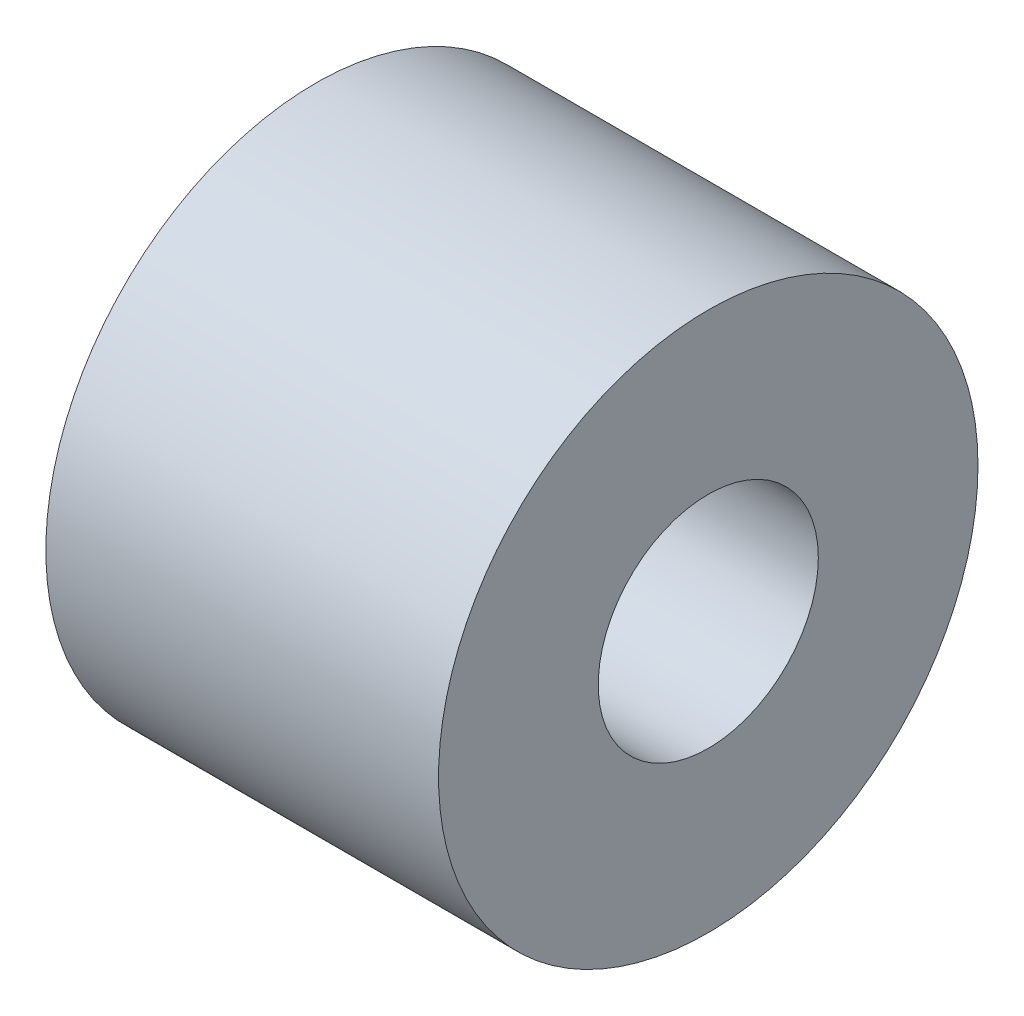
ISO-10303-21;
HEADER;
FILE_DESCRIPTION(('STEP AP214'),'2;1');
FILE_NAME('part.step','',(''),(''),'','','');
FILE_SCHEMA(('AUTOMOTIVE_DESIGN { 1 0 10303 214 1 1 1 1 }'));
ENDSEC;
DATA;
#1=APPLICATION_CONTEXT('core data for automotive mechanical design processes');
#2=APPLICATION_PROTOCOL_DEFINITION('international standard','automotive_design',2000,#1);
#3=PRODUCT_CONTEXT('',#1,'mechanical');
#4=PRODUCT('Part','Part','',(#3));
#5=PRODUCT_RELATED_PRODUCT_CATEGORY('part','',(#4));
#6=PRODUCT_DEFINITION_FORMATION('','',#4);
#7=PRODUCT_DEFINITION_CONTEXT('part definition',#1,'design');
#8=PRODUCT_DEFINITION('design','',#6,#7);
#9=PRODUCT_DEFINITION_SHAPE('','',#8);
#10=(LENGTH_UNIT() NAMED_UNIT(*) SI_UNIT(.MILLI.,.METRE.));
#11=(NAMED_UNIT(*) PLANE_ANGLE_UNIT() SI_UNIT($,.RADIAN.));
#12=(NAMED_UNIT(*) SI_UNIT($,.STERADIAN.) SOLID_ANGLE_UNIT());
#13=UNCERTAINTY_MEASURE_WITH_UNIT(LENGTH_MEASURE(1.E-05),#10,'distance_accuracy_value','');
#14=(GEOMETRIC_REPRESENTATION_CONTEXT(3) GLOBAL_UNCERTAINTY_ASSIGNED_CONTEXT((#13)) GLOBAL_UNIT_ASSIGNED_CONTEXT((#10,
#11,#12)) REPRESENTATION_CONTEXT('',''));
#15=CARTESIAN_POINT('',(0.,0.,0.));
#16=DIRECTION('',(0.,0.,1.));
#17=DIRECTION('',(1.,0.,0.));
#18=AXIS2_PLACEMENT_3D('',#15,#16,#17);
#19=CARTESIAN_POINT('',(4.55,0.,0.));
#20=DIRECTION('',(1.,0.,0.));
#21=DIRECTION('',(0.,0.,-1.));
#22=AXIS2_PLACEMENT_3D('',#19,#20,#21);
#23=PLANE('',#22);
#24=CARTESIAN_POINT('',(4.55,0.,0.));
#25=DIRECTION('',(1.,0.,0.));
#26=DIRECTION('',(0.,0.,-1.));
#27=AXIS2_PLACEMENT_3D('',#24,#25,#26);
#28=CIRCLE('',#27,6.25);
#29=CARTESIAN_POINT('',(4.55,0.,-6.25));
#30=VERTEX_POINT('',#29);
#31=EDGE_CURVE('E10',#30,#30,#28,.T.);
#32=ORIENTED_EDGE('',*,*,#31,.T.);
#33=EDGE_LOOP('',(#32));
#34=FACE_BOUND('',#33,.T.);
#35=CARTESIAN_POINT('',(4.55,0.,0.));
#36=DIRECTION('',(1.,0.,0.));
#37=DIRECTION('',(0.,0.,-1.));
#38=AXIS2_PLACEMENT_3D('',#35,#36,#37);
#39=CIRCLE('',#38,2.55);
#40=CARTESIAN_POINT('',(4.55,0.,-2.55));
#41=VERTEX_POINT('',#40);
#42=EDGE_CURVE('E48',#41,#41,#39,.T.);
#43=ORIENTED_EDGE('',*,*,#42,.F.);
#44=EDGE_LOOP('',(#43));
#45=FACE_BOUND('',#44,.T.);
#46=ADVANCED_FACE('F37',(#34,#45),#23,.T.);
#47=CARTESIAN_POINT('',(-4.55,0.,0.));
#48=DIRECTION('',(1.,0.,0.));
#49=DIRECTION('',(0.,0.,-1.));
#50=AXIS2_PLACEMENT_3D('',#47,#48,#49);
#51=PLANE('',#50);
#52=CARTESIAN_POINT('',(-4.55,0.,0.));
#53=DIRECTION('',(1.,0.,0.));
#54=DIRECTION('',(0.,0.,-1.));
#55=AXIS2_PLACEMENT_3D('',#52,#53,#54);
#56=CIRCLE('',#55,6.25);
#57=CARTESIAN_POINT('',(-4.55,0.,-6.25));
#58=VERTEX_POINT('',#57);
#59=EDGE_CURVE('E41',#58,#58,#56,.T.);
#60=ORIENTED_EDGE('',*,*,#59,.F.);
#61=EDGE_LOOP('',(#60));
#62=FACE_BOUND('',#61,.T.);
#63=CARTESIAN_POINT('',(-4.55,0.,0.));
#64=DIRECTION('',(1.,0.,0.));
#65=DIRECTION('',(0.,0.,-1.));
#66=AXIS2_PLACEMENT_3D('',#63,#64,#65);
#67=CIRCLE('',#66,2.55);
#68=CARTESIAN_POINT('',(-4.55,0.,-2.55));
#69=VERTEX_POINT('',#68);
#70=EDGE_CURVE('E50',#69,#69,#67,.T.);
#71=ORIENTED_EDGE('',*,*,#70,.T.);
#72=EDGE_LOOP('',(#71));
#73=FACE_BOUND('',#72,.T.);
#74=ADVANCED_FACE('F60',(#62,#73),#51,.F.);
#75=CARTESIAN_POINT('',(4.55,0.,0.));
#76=DIRECTION('',(-1.,0.,0.));
#77=DIRECTION('',(0.,0.,1.));
#78=AXIS2_PLACEMENT_3D('',#75,#76,#77);
#79=CYLINDRICAL_SURFACE('',#78,6.25);
#80=ORIENTED_EDGE('',*,*,#31,.F.);
#81=EDGE_LOOP('',(#80));
#82=FACE_BOUND('',#81,.T.);
#83=ORIENTED_EDGE('',*,*,#59,.T.);
#84=EDGE_LOOP('',(#83));
#85=FACE_BOUND('',#84,.T.);
#86=ADVANCED_FACE('F39',(#82,#85),#79,.T.);
#87=CARTESIAN_POINT('',(4.55,0.,0.));
#88=DIRECTION('',(-1.,0.,0.));
#89=DIRECTION('',(0.,0.,1.));
#90=AXIS2_PLACEMENT_3D('',#87,#88,#89);
#91=CYLINDRICAL_SURFACE('',#90,2.55);
#92=ORIENTED_EDGE('',*,*,#42,.T.);
#93=EDGE_LOOP('',(#92));
#94=FACE_BOUND('',#93,.T.);
#95=ORIENTED_EDGE('',*,*,#70,.F.);
#96=EDGE_LOOP('',(#95));
#97=FACE_BOUND('',#96,.T.);
#98=ADVANCED_FACE('F56',(#94,#97),#91,.F.);
#99=CLOSED_SHELL('',(#46,#74,#86,#98));
#100=MANIFOLD_SOLID_BREP('B2',#99);
#101=ADVANCED_BREP_SHAPE_REPRESENTATION('',(#18,#100),#14);
#102=SHAPE_DEFINITION_REPRESENTATION(#9,#101);
ENDSEC;
END-ISO-10303-21;
